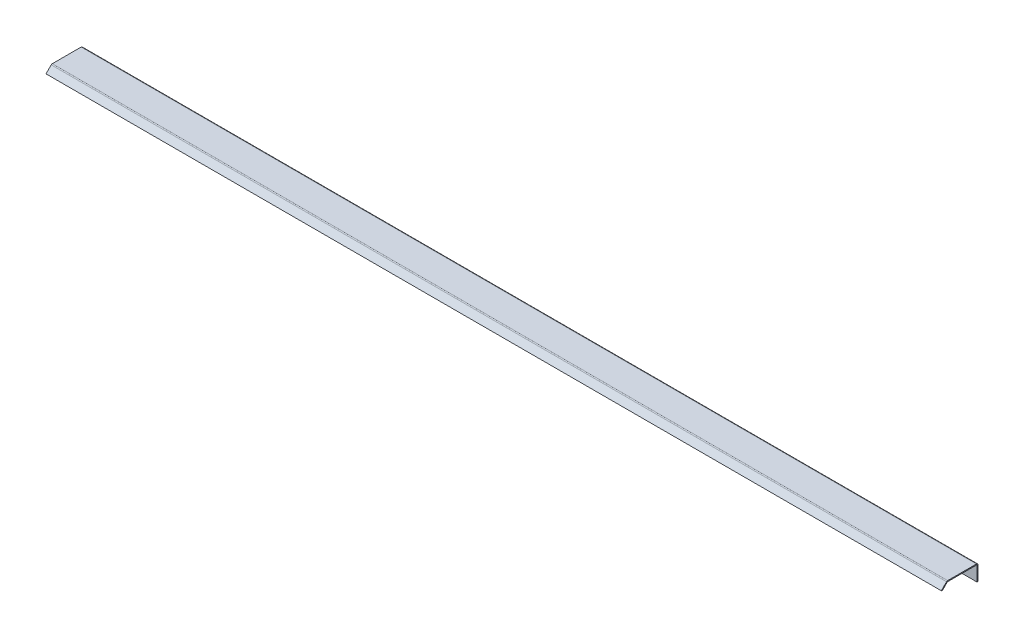
ISO-10303-21;
HEADER;
FILE_DESCRIPTION(('STEP AP214'),'2;1');
FILE_NAME('part.step','',(''),(''),'','','');
FILE_SCHEMA(('AUTOMOTIVE_DESIGN { 1 0 10303 214 1 1 1 1 }'));
ENDSEC;
DATA;
#1=APPLICATION_CONTEXT('core data for automotive mechanical design processes');
#2=APPLICATION_PROTOCOL_DEFINITION('international standard','automotive_design',2000,#1);
#3=PRODUCT_CONTEXT('',#1,'mechanical');
#4=PRODUCT('Part','Part','',(#3));
#5=PRODUCT_RELATED_PRODUCT_CATEGORY('part','',(#4));
#6=PRODUCT_DEFINITION_FORMATION('','',#4);
#7=PRODUCT_DEFINITION_CONTEXT('part definition',#1,'design');
#8=PRODUCT_DEFINITION('design','',#6,#7);
#9=PRODUCT_DEFINITION_SHAPE('','',#8);
#10=(LENGTH_UNIT() NAMED_UNIT(*) SI_UNIT(.MILLI.,.METRE.));
#11=(NAMED_UNIT(*) PLANE_ANGLE_UNIT() SI_UNIT($,.RADIAN.));
#12=(NAMED_UNIT(*) SI_UNIT($,.STERADIAN.) SOLID_ANGLE_UNIT());
#13=UNCERTAINTY_MEASURE_WITH_UNIT(LENGTH_MEASURE(1.E-05),#10,'distance_accuracy_value','');
#14=(GEOMETRIC_REPRESENTATION_CONTEXT(3) GLOBAL_UNCERTAINTY_ASSIGNED_CONTEXT((#13)) GLOBAL_UNIT_ASSIGNED_CONTEXT((#10,
#11,#12)) REPRESENTATION_CONTEXT('',''));
#15=CARTESIAN_POINT('',(0.,0.,0.));
#16=DIRECTION('',(0.,0.,1.));
#17=DIRECTION('',(1.,0.,0.));
#18=AXIS2_PLACEMENT_3D('',#15,#16,#17);
#19=CARTESIAN_POINT('',(-560.,-1.93660000000001,1.19999999999998));
#20=DIRECTION('',(-1.,0.,0.));
#21=DIRECTION('',(0.,0.,1.));
#22=AXIS2_PLACEMENT_3D('',#19,#20,#21);
#23=PLANE('',#22);
#24=DIRECTION('',(0.,0.,1.));
#25=VECTOR('',#24,1.);
#26=CARTESIAN_POINT('',(-560.,-1.19999999999998,0.));
#27=LINE('',#26,#25);
#28=CARTESIAN_POINT('',(-560.,-1.19999999999998,1.93659999999996));
#29=VERTEX_POINT('',#28);
#30=CARTESIAN_POINT('',(-560.,-1.20000000000003,37.9978340151083));
#31=VERTEX_POINT('',#30);
#32=EDGE_CURVE('E273',#29,#31,#27,.T.);
#33=ORIENTED_EDGE('',*,*,#32,.T.);
#34=DIRECTION('',(0.,1.,0.));
#35=VECTOR('',#34,1.);
#36=CARTESIAN_POINT('',(-560.,-1.20000000000015,37.9978340151083));
#37=LINE('',#36,#35);
#38=CARTESIAN_POINT('',(-560.,-1.66533453693773E-13,37.9978340151083));
#39=VERTEX_POINT('',#38);
#40=EDGE_CURVE('E228',#31,#39,#37,.T.);
#41=ORIENTED_EDGE('',*,*,#40,.T.);
#42=DIRECTION('',(0.,0.,1.));
#43=VECTOR('',#42,1.);
#44=CARTESIAN_POINT('',(-560.,0.,0.));
#45=LINE('',#44,#43);
#46=CARTESIAN_POINT('',(-560.,0.,1.93659999999996));
#47=VERTEX_POINT('',#46);
#48=EDGE_CURVE('E239',#47,#39,#45,.T.);
#49=ORIENTED_EDGE('',*,*,#48,.F.);
#50=DIRECTION('',(0.,-1.,0.));
#51=VECTOR('',#50,1.);
#52=CARTESIAN_POINT('',(-560.,0.,1.93659999999996));
#53=LINE('',#52,#51);
#54=EDGE_CURVE('E319',#47,#29,#53,.T.);
#55=ORIENTED_EDGE('',*,*,#54,.T.);
#56=EDGE_LOOP('',(#33,#41,#49,#55));
#57=FACE_BOUND('',#56,.T.);
#58=ADVANCED_FACE('F64',(#57),#23,.T.);
#59=CARTESIAN_POINT('',(560.,0.,0.));
#60=DIRECTION('',(0.,-1.,0.));
#61=DIRECTION('',(0.,0.,-1.));
#62=AXIS2_PLACEMENT_3D('',#59,#60,#61);
#63=PLANE('',#62);
#64=DIRECTION('',(-1.,0.,0.));
#65=VECTOR('',#64,1.);
#66=CARTESIAN_POINT('',(-560.,-1.66533453693773E-13,37.9978340151083));
#67=LINE('',#66,#65);
#68=CARTESIAN_POINT('',(559.999999999999,0.,37.9978340151083));
#69=VERTEX_POINT('',#68);
#70=EDGE_CURVE('E163',#39,#69,#67,.F.);
#71=ORIENTED_EDGE('',*,*,#70,.T.);
#72=DIRECTION('',(0.,0.,1.));
#73=VECTOR('',#72,1.);
#74=CARTESIAN_POINT('',(560.,0.,0.));
#75=LINE('',#74,#73);
#76=CARTESIAN_POINT('',(560.,0.,1.93659999999996));
#77=VERTEX_POINT('',#76);
#78=EDGE_CURVE('E243',#77,#69,#75,.T.);
#79=ORIENTED_EDGE('',*,*,#78,.F.);
#80=DIRECTION('',(-1.,0.,0.));
#81=VECTOR('',#80,1.);
#82=CARTESIAN_POINT('',(560.,0.,1.93659999999996));
#83=LINE('',#82,#81);
#84=EDGE_CURVE('E270',#77,#47,#83,.T.);
#85=ORIENTED_EDGE('',*,*,#84,.T.);
#86=ORIENTED_EDGE('',*,*,#48,.T.);
#87=EDGE_LOOP('',(#71,#79,#85,#86));
#88=FACE_BOUND('',#87,.T.);
#89=ADVANCED_FACE('F335',(#88),#63,.F.);
#90=CARTESIAN_POINT('',(560.,-1.19999999999998,0.));
#91=DIRECTION('',(0.,-1.,0.));
#92=DIRECTION('',(0.,0.,-1.));
#93=AXIS2_PLACEMENT_3D('',#90,#91,#92);
#94=PLANE('',#93);
#95=DIRECTION('',(0.,0.,1.));
#96=VECTOR('',#95,1.);
#97=CARTESIAN_POINT('',(560.,-1.19999999999998,0.));
#98=LINE('',#97,#96);
#99=CARTESIAN_POINT('',(560.,-1.19999999999998,1.93659999999996));
#100=VERTEX_POINT('',#99);
#101=CARTESIAN_POINT('',(560.,-1.20000000000003,37.9978340151083));
#102=VERTEX_POINT('',#101);
#103=EDGE_CURVE('E246',#100,#102,#98,.T.);
#104=ORIENTED_EDGE('',*,*,#103,.T.);
#105=DIRECTION('',(-1.,0.,0.));
#106=VECTOR('',#105,1.);
#107=CARTESIAN_POINT('',(-560.,-1.20000000000015,37.9978340151083));
#108=LINE('',#107,#106);
#109=EDGE_CURVE('E80',#31,#102,#108,.F.);
#110=ORIENTED_EDGE('',*,*,#109,.F.);
#111=ORIENTED_EDGE('',*,*,#32,.F.);
#112=DIRECTION('',(-1.,0.,0.));
#113=VECTOR('',#112,1.);
#114=CARTESIAN_POINT('',(560.,-1.19999999999998,1.93659999999996));
#115=LINE('',#114,#113);
#116=EDGE_CURVE('E312',#100,#29,#115,.T.);
#117=ORIENTED_EDGE('',*,*,#116,.F.);
#118=EDGE_LOOP('',(#104,#110,#111,#117));
#119=FACE_BOUND('',#118,.T.);
#120=ADVANCED_FACE('F373',(#119),#94,.T.);
#121=CARTESIAN_POINT('',(560.,-1.93660000000001,0.));
#122=DIRECTION('',(1.,0.,0.));
#123=DIRECTION('',(0.,0.,-1.));
#124=AXIS2_PLACEMENT_3D('',#121,#122,#123);
#125=PLANE('',#124);
#126=DIRECTION('',(0.,0.,1.));
#127=VECTOR('',#126,1.);
#128=CARTESIAN_POINT('',(560.,-1.93660000000001,0.));
#129=LINE('',#128,#127);
#130=CARTESIAN_POINT('',(560.,-1.93660000000001,0.));
#131=VERTEX_POINT('',#130);
#132=CARTESIAN_POINT('',(560.,-1.93660000000001,1.19999999999998));
#133=VERTEX_POINT('',#132);
#134=EDGE_CURVE('E13',#131,#133,#129,.T.);
#135=ORIENTED_EDGE('',*,*,#134,.F.);
#136=CARTESIAN_POINT('',(560.,-1.93660000000001,1.93659999999996));
#137=DIRECTION('',(-1.,0.,0.));
#138=DIRECTION('',(0.,0.,1.));
#139=AXIS2_PLACEMENT_3D('',#136,#137,#138);
#140=CIRCLE('',#139,1.9366);
#141=EDGE_CURVE('E266',#131,#77,#140,.F.);
#142=ORIENTED_EDGE('',*,*,#141,.T.);
#143=DIRECTION('',(0.,1.,0.));
#144=VECTOR('',#143,1.);
#145=CARTESIAN_POINT('',(560.,-1.19999999999998,1.93659999999996));
#146=LINE('',#145,#144);
#147=EDGE_CURVE('E73',#100,#77,#146,.T.);
#148=ORIENTED_EDGE('',*,*,#147,.F.);
#149=CARTESIAN_POINT('',(560.,-1.93660000000001,1.93659999999996));
#150=DIRECTION('',(1.,0.,0.));
#151=DIRECTION('',(0.,0.,-1.));
#152=AXIS2_PLACEMENT_3D('',#149,#150,#151);
#153=CIRCLE('',#152,0.7366);
#154=EDGE_CURVE('E250',#133,#100,#153,.T.);
#155=ORIENTED_EDGE('',*,*,#154,.F.);
#156=EDGE_LOOP('',(#135,#142,#148,#155));
#157=FACE_BOUND('',#156,.T.);
#158=ADVANCED_FACE('F66',(#157),#125,.T.);
#159=CARTESIAN_POINT('',(560.,-1.19999999999998,1.93659999999996));
#160=DIRECTION('',(1.,0.,0.));
#161=DIRECTION('',(0.,0.,-1.));
#162=AXIS2_PLACEMENT_3D('',#159,#160,#161);
#163=PLANE('',#162);
#164=DIRECTION('',(0.,1.,0.));
#165=VECTOR('',#164,1.);
#166=CARTESIAN_POINT('',(560.,-20.,0.));
#167=LINE('',#166,#165);
#168=CARTESIAN_POINT('',(560.,-20.,0.));
#169=VERTEX_POINT('',#168);
#170=EDGE_CURVE('E262',#169,#131,#167,.T.);
#171=ORIENTED_EDGE('',*,*,#170,.T.);
#172=ORIENTED_EDGE('',*,*,#134,.T.);
#173=DIRECTION('',(0.,1.,0.));
#174=VECTOR('',#173,1.);
#175=CARTESIAN_POINT('',(560.,-20.,1.19999999999998));
#176=LINE('',#175,#174);
#177=CARTESIAN_POINT('',(560.,-20.,1.19999999999998));
#178=VERTEX_POINT('',#177);
#179=EDGE_CURVE('E254',#178,#133,#176,.T.);
#180=ORIENTED_EDGE('',*,*,#179,.F.);
#181=DIRECTION('',(0.,0.,1.));
#182=VECTOR('',#181,1.);
#183=CARTESIAN_POINT('',(560.,-20.,0.));
#184=LINE('',#183,#182);
#185=EDGE_CURVE('E258',#169,#178,#184,.T.);
#186=ORIENTED_EDGE('',*,*,#185,.F.);
#187=EDGE_LOOP('',(#171,#172,#180,#186));
#188=FACE_BOUND('',#187,.T.);
#189=ADVANCED_FACE('F380',(#188),#163,.T.);
#190=CARTESIAN_POINT('',(-560.,0.,1.93659999999996));
#191=DIRECTION('',(-1.,0.,0.));
#192=DIRECTION('',(0.,0.,1.));
#193=AXIS2_PLACEMENT_3D('',#190,#191,#192);
#194=PLANE('',#193);
#195=ORIENTED_EDGE('',*,*,#54,.F.);
#196=CARTESIAN_POINT('',(-560.,-1.93660000000001,1.93659999999996));
#197=DIRECTION('',(-1.,0.,0.));
#198=DIRECTION('',(0.,0.,1.));
#199=AXIS2_PLACEMENT_3D('',#196,#197,#198);
#200=CIRCLE('',#199,1.9366);
#201=CARTESIAN_POINT('',(-560.,-1.93660000000001,0.));
#202=VERTEX_POINT('',#201);
#203=EDGE_CURVE('E247',#202,#47,#200,.F.);
#204=ORIENTED_EDGE('',*,*,#203,.F.);
#205=DIRECTION('',(0.,0.,-1.));
#206=VECTOR('',#205,1.);
#207=CARTESIAN_POINT('',(-560.,-1.93660000000001,1.19999999999998));
#208=LINE('',#207,#206);
#209=CARTESIAN_POINT('',(-560.,-1.93660000000001,1.19999999999998));
#210=VERTEX_POINT('',#209);
#211=EDGE_CURVE('E316',#210,#202,#208,.T.);
#212=ORIENTED_EDGE('',*,*,#211,.F.);
#213=CARTESIAN_POINT('',(-560.,-1.93660000000001,1.93659999999996));
#214=DIRECTION('',(1.,0.,0.));
#215=DIRECTION('',(0.,0.,-1.));
#216=AXIS2_PLACEMENT_3D('',#213,#214,#215);
#217=CIRCLE('',#216,0.7366);
#218=EDGE_CURVE('E276',#210,#29,#217,.T.);
#219=ORIENTED_EDGE('',*,*,#218,.T.);
#220=EDGE_LOOP('',(#195,#204,#212,#219));
#221=FACE_BOUND('',#220,.T.);
#222=ADVANCED_FACE('F377',(#221),#194,.T.);
#223=CARTESIAN_POINT('',(560.,-1.93660000000001,1.93659999999996));
#224=DIRECTION('',(-1.,0.,0.));
#225=DIRECTION('',(0.,0.,1.));
#226=AXIS2_PLACEMENT_3D('',#223,#224,#225);
#227=CYLINDRICAL_SURFACE('',#226,0.7366);
#228=ORIENTED_EDGE('',*,*,#218,.F.);
#229=DIRECTION('',(-1.,0.,0.));
#230=VECTOR('',#229,1.);
#231=CARTESIAN_POINT('',(560.,-1.93660000000001,1.19999999999998));
#232=LINE('',#231,#230);
#233=EDGE_CURVE('E308',#133,#210,#232,.T.);
#234=ORIENTED_EDGE('',*,*,#233,.F.);
#235=ORIENTED_EDGE('',*,*,#154,.T.);
#236=ORIENTED_EDGE('',*,*,#116,.T.);
#237=EDGE_LOOP('',(#228,#234,#235,#236));
#238=FACE_BOUND('',#237,.T.);
#239=ADVANCED_FACE('F379',(#238),#227,.F.);
#240=CARTESIAN_POINT('',(560.,-20.,1.19999999999998));
#241=DIRECTION('',(0.,0.,1.));
#242=DIRECTION('',(1.,0.,0.));
#243=AXIS2_PLACEMENT_3D('',#240,#241,#242);
#244=PLANE('',#243);
#245=DIRECTION('',(0.,1.,0.));
#246=VECTOR('',#245,1.);
#247=CARTESIAN_POINT('',(-560.,-20.,1.19999999999998));
#248=LINE('',#247,#246);
#249=CARTESIAN_POINT('',(-560.,-20.,1.19999999999998));
#250=VERTEX_POINT('',#249);
#251=EDGE_CURVE('E280',#250,#210,#248,.T.);
#252=ORIENTED_EDGE('',*,*,#251,.F.);
#253=DIRECTION('',(-1.,0.,0.));
#254=VECTOR('',#253,1.);
#255=CARTESIAN_POINT('',(560.,-20.,1.19999999999998));
#256=LINE('',#255,#254);
#257=EDGE_CURVE('E305',#178,#250,#256,.T.);
#258=ORIENTED_EDGE('',*,*,#257,.F.);
#259=ORIENTED_EDGE('',*,*,#179,.T.);
#260=ORIENTED_EDGE('',*,*,#233,.T.);
#261=EDGE_LOOP('',(#252,#258,#259,#260));
#262=FACE_BOUND('',#261,.T.);
#263=ADVANCED_FACE('F403',(#262),#244,.T.);
#264=CARTESIAN_POINT('',(560.,-20.,0.));
#265=DIRECTION('',(0.,-1.,0.));
#266=DIRECTION('',(0.,0.,-1.));
#267=AXIS2_PLACEMENT_3D('',#264,#265,#266);
#268=PLANE('',#267);
#269=DIRECTION('',(0.,0.,1.));
#270=VECTOR('',#269,1.);
#271=CARTESIAN_POINT('',(-560.,-20.,0.));
#272=LINE('',#271,#270);
#273=CARTESIAN_POINT('',(-560.,-20.,0.));
#274=VERTEX_POINT('',#273);
#275=EDGE_CURVE('E284',#274,#250,#272,.T.);
#276=ORIENTED_EDGE('',*,*,#275,.F.);
#277=DIRECTION('',(-1.,0.,0.));
#278=VECTOR('',#277,1.);
#279=CARTESIAN_POINT('',(560.,-20.,0.));
#280=LINE('',#279,#278);
#281=EDGE_CURVE('E302',#169,#274,#280,.T.);
#282=ORIENTED_EDGE('',*,*,#281,.F.);
#283=ORIENTED_EDGE('',*,*,#185,.T.);
#284=ORIENTED_EDGE('',*,*,#257,.T.);
#285=EDGE_LOOP('',(#276,#282,#283,#284));
#286=FACE_BOUND('',#285,.T.);
#287=ADVANCED_FACE('F406',(#286),#268,.T.);
#288=CARTESIAN_POINT('',(560.,-20.,0.));
#289=DIRECTION('',(0.,0.,1.));
#290=DIRECTION('',(1.,0.,0.));
#291=AXIS2_PLACEMENT_3D('',#288,#289,#290);
#292=PLANE('',#291);
#293=DIRECTION('',(0.,1.,0.));
#294=VECTOR('',#293,1.);
#295=CARTESIAN_POINT('',(-560.,-20.,0.));
#296=LINE('',#295,#294);
#297=EDGE_CURVE('E288',#274,#202,#296,.T.);
#298=ORIENTED_EDGE('',*,*,#297,.T.);
#299=DIRECTION('',(-1.,0.,0.));
#300=VECTOR('',#299,1.);
#301=CARTESIAN_POINT('',(560.,-1.93660000000001,0.));
#302=LINE('',#301,#300);
#303=EDGE_CURVE('E298',#131,#202,#302,.T.);
#304=ORIENTED_EDGE('',*,*,#303,.F.);
#305=ORIENTED_EDGE('',*,*,#170,.F.);
#306=ORIENTED_EDGE('',*,*,#281,.T.);
#307=EDGE_LOOP('',(#298,#304,#305,#306));
#308=FACE_BOUND('',#307,.T.);
#309=ADVANCED_FACE('F393',(#308),#292,.F.);
#310=CARTESIAN_POINT('',(560.,-1.93660000000001,1.93659999999996));
#311=DIRECTION('',(-1.,0.,0.));
#312=DIRECTION('',(0.,0.,1.));
#313=AXIS2_PLACEMENT_3D('',#310,#311,#312);
#314=CYLINDRICAL_SURFACE('',#313,1.9366);
#315=ORIENTED_EDGE('',*,*,#203,.T.);
#316=ORIENTED_EDGE('',*,*,#84,.F.);
#317=ORIENTED_EDGE('',*,*,#141,.F.);
#318=ORIENTED_EDGE('',*,*,#303,.T.);
#319=EDGE_LOOP('',(#315,#316,#317,#318));
#320=FACE_BOUND('',#319,.T.);
#321=ADVANCED_FACE('F331',(#320),#314,.T.);
#322=CARTESIAN_POINT('',(560.,-1.93660000000001,1.93659999999996));
#323=DIRECTION('',(1.,0.,0.));
#324=DIRECTION('',(0.,0.,-1.));
#325=AXIS2_PLACEMENT_3D('',#322,#323,#324);
#326=PLANE('',#325);
#327=DIRECTION('',(6.02890591705265E-13,1.,0.));
#328=VECTOR('',#327,1.);
#329=CARTESIAN_POINT('',(559.999999999999,-1.19999999999998,37.9978340151083));
#330=LINE('',#329,#328);
#331=EDGE_CURVE('E88',#102,#69,#330,.T.);
#332=ORIENTED_EDGE('',*,*,#331,.F.);
#333=ORIENTED_EDGE('',*,*,#103,.F.);
#334=ORIENTED_EDGE('',*,*,#147,.T.);
#335=ORIENTED_EDGE('',*,*,#78,.T.);
#336=EDGE_LOOP('',(#332,#333,#334,#335));
#337=FACE_BOUND('',#336,.T.);
#338=ADVANCED_FACE('F323',(#337),#326,.T.);
#339=CARTESIAN_POINT('',(-560.,-1.93660000000001,1.93659999999996));
#340=DIRECTION('',(1.,0.,0.));
#341=DIRECTION('',(0.,0.,-1.));
#342=AXIS2_PLACEMENT_3D('',#339,#340,#341);
#343=PLANE('',#342);
#344=ORIENTED_EDGE('',*,*,#251,.T.);
#345=ORIENTED_EDGE('',*,*,#211,.T.);
#346=ORIENTED_EDGE('',*,*,#297,.F.);
#347=ORIENTED_EDGE('',*,*,#275,.T.);
#348=EDGE_LOOP('',(#344,#345,#346,#347));
#349=FACE_BOUND('',#348,.T.);
#350=ADVANCED_FACE('F415',(#349),#343,.F.);
#351=CARTESIAN_POINT('',(560.,-1.93659999999996,37.9978340151083));
#352=DIRECTION('',(1.,0.,0.));
#353=DIRECTION('',(0.,1.,0.));
#354=AXIS2_PLACEMENT_3D('',#351,#352,#353);
#355=PLANE('',#354);
#356=DIRECTION('',(0.,0.707106781186551,0.707106781186544));
#357=VECTOR('',#356,1.);
#358=CARTESIAN_POINT('',(560.,-0.567217007554133,39.3672170075541));
#359=LINE('',#358,#357);
#360=CARTESIAN_POINT('',(559.999999999999,-1.415745144978,38.5186888701302));
#361=VERTEX_POINT('',#360);
#362=CARTESIAN_POINT('',(559.999999999999,-0.567217007554133,39.3672170075541));
#363=VERTEX_POINT('',#362);
#364=EDGE_CURVE('E220',#361,#363,#359,.T.);
#365=ORIENTED_EDGE('',*,*,#364,.F.);
#366=CARTESIAN_POINT('',(560.,-1.93659999999996,37.9978340151083));
#367=DIRECTION('',(-1.,0.,0.));
#368=DIRECTION('',(0.,-1.,0.));
#369=AXIS2_PLACEMENT_3D('',#366,#367,#368);
#370=CIRCLE('',#369,0.736599999999941);
#371=EDGE_CURVE('E167',#102,#361,#370,.F.);
#372=ORIENTED_EDGE('',*,*,#371,.F.);
#373=ORIENTED_EDGE('',*,*,#331,.T.);
#374=CARTESIAN_POINT('',(559.999999999999,-1.93659999999996,37.9978340151083));
#375=DIRECTION('',(-1.,0.,0.));
#376=DIRECTION('',(0.,-1.,0.));
#377=AXIS2_PLACEMENT_3D('',#374,#375,#376);
#378=CIRCLE('',#377,1.93659999999994);
#379=EDGE_CURVE('E226',#69,#363,#378,.F.);
#380=ORIENTED_EDGE('',*,*,#379,.T.);
#381=EDGE_LOOP('',(#365,#372,#373,#380));
#382=FACE_BOUND('',#381,.T.);
#383=ADVANCED_FACE('F338',(#382),#355,.T.);
#384=CARTESIAN_POINT('',(-560.,-1.93660000000012,37.9978340151083));
#385=DIRECTION('',(1.,0.,0.));
#386=DIRECTION('',(0.,1.,0.));
#387=AXIS2_PLACEMENT_3D('',#384,#385,#386);
#388=PLANE('',#387);
#389=CARTESIAN_POINT('',(-560.,-1.93660000000012,37.9978340151083));
#390=DIRECTION('',(-1.,0.,0.));
#391=DIRECTION('',(0.,-1.,0.));
#392=AXIS2_PLACEMENT_3D('',#389,#390,#391);
#393=CIRCLE('',#392,0.736599999999941);
#394=CARTESIAN_POINT('',(-560.,-1.41574514497811,38.5186888701302));
#395=VERTEX_POINT('',#394);
#396=EDGE_CURVE('E174',#395,#31,#393,.T.);
#397=ORIENTED_EDGE('',*,*,#396,.F.);
#398=DIRECTION('',(0.,0.707106781186551,0.707106781186544));
#399=VECTOR('',#398,1.);
#400=CARTESIAN_POINT('',(-560.,-1.415745144978,38.5186888701303));
#401=LINE('',#400,#399);
#402=CARTESIAN_POINT('',(-560.,-0.567217007554188,39.3672170075541));
#403=VERTEX_POINT('',#402);
#404=EDGE_CURVE('E171',#395,#403,#401,.T.);
#405=ORIENTED_EDGE('',*,*,#404,.T.);
#406=CARTESIAN_POINT('',(-560.,-1.93660000000012,37.9978340151083));
#407=DIRECTION('',(-1.,0.,0.));
#408=DIRECTION('',(0.,-1.,0.));
#409=AXIS2_PLACEMENT_3D('',#406,#407,#408);
#410=CIRCLE('',#409,1.93659999999994);
#411=EDGE_CURVE('E155',#403,#39,#410,.T.);
#412=ORIENTED_EDGE('',*,*,#411,.T.);
#413=ORIENTED_EDGE('',*,*,#40,.F.);
#414=EDGE_LOOP('',(#397,#405,#412,#413));
#415=FACE_BOUND('',#414,.T.);
#416=ADVANCED_FACE('F172',(#415),#388,.F.);
#417=CARTESIAN_POINT('',(-560.,-1.93660000000012,37.9978340151083));
#418=DIRECTION('',(-1.,0.,0.));
#419=DIRECTION('',(0.,0.707106781186551,0.707106781186544));
#420=AXIS2_PLACEMENT_3D('',#417,#418,#419);
#421=CYLINDRICAL_SURFACE('',#420,1.93659999999994);
#422=ORIENTED_EDGE('',*,*,#70,.F.);
#423=ORIENTED_EDGE('',*,*,#411,.F.);
#424=DIRECTION('',(-1.,0.,0.));
#425=VECTOR('',#424,1.);
#426=CARTESIAN_POINT('',(0.,-0.567217007554133,39.3672170075541));
#427=LINE('',#426,#425);
#428=EDGE_CURVE('E160',#363,#403,#427,.T.);
#429=ORIENTED_EDGE('',*,*,#428,.F.);
#430=ORIENTED_EDGE('',*,*,#379,.F.);
#431=EDGE_LOOP('',(#422,#423,#429,#430));
#432=FACE_BOUND('',#431,.T.);
#433=ADVANCED_FACE('F157',(#432),#421,.T.);
#434=CARTESIAN_POINT('',(-560.,-1.93660000000012,37.9978340151083));
#435=DIRECTION('',(-1.,0.,0.));
#436=DIRECTION('',(0.,0.707106781186551,0.707106781186544));
#437=AXIS2_PLACEMENT_3D('',#434,#435,#436);
#438=CYLINDRICAL_SURFACE('',#437,0.736599999999941);
#439=ORIENTED_EDGE('',*,*,#109,.T.);
#440=ORIENTED_EDGE('',*,*,#371,.T.);
#441=DIRECTION('',(1.,0.,0.));
#442=VECTOR('',#441,1.);
#443=CARTESIAN_POINT('',(560.,-1.415745144978,38.5186888701302));
#444=LINE('',#443,#442);
#445=EDGE_CURVE('E180',#361,#395,#444,.F.);
#446=ORIENTED_EDGE('',*,*,#445,.T.);
#447=ORIENTED_EDGE('',*,*,#396,.T.);
#448=EDGE_LOOP('',(#439,#440,#446,#447));
#449=FACE_BOUND('',#448,.T.);
#450=ADVANCED_FACE('F341',(#449),#438,.F.);
#451=CARTESIAN_POINT('',(-560.,-0.351471862576169,39.1514718625762));
#452=DIRECTION('',(-1.,0.,0.));
#453=DIRECTION('',(0.,0.,1.));
#454=AXIS2_PLACEMENT_3D('',#451,#452,#453);
#455=PLANE('',#454);
#456=DIRECTION('',(0.,0.707106781186544,-0.707106781186551));
#457=VECTOR('',#456,1.);
#458=CARTESIAN_POINT('',(-560.,-0.351471862576169,39.1514718625762));
#459=LINE('',#458,#457);
#460=CARTESIAN_POINT('',(-560.,-7.07106781186537,45.8710678118655));
#461=VERTEX_POINT('',#460);
#462=EDGE_CURVE('E187',#461,#403,#459,.T.);
#463=ORIENTED_EDGE('',*,*,#462,.T.);
#464=ORIENTED_EDGE('',*,*,#404,.F.);
#465=DIRECTION('',(0.,-0.707106781186544,0.707106781186551));
#466=VECTOR('',#465,1.);
#467=CARTESIAN_POINT('',(-560.,19.4,17.702943725152));
#468=LINE('',#467,#466);
#469=CARTESIAN_POINT('',(-560.,-7.91959594928923,45.0225396744417));
#470=VERTEX_POINT('',#469);
#471=EDGE_CURVE('E211',#470,#395,#468,.F.);
#472=ORIENTED_EDGE('',*,*,#471,.F.);
#473=DIRECTION('',(0.,-0.707106781186551,-0.707106781186544));
#474=VECTOR('',#473,1.);
#475=CARTESIAN_POINT('',(-560.,-7.07106781186537,45.8710678118655));
#476=LINE('',#475,#474);
#477=EDGE_CURVE('E193',#461,#470,#476,.T.);
#478=ORIENTED_EDGE('',*,*,#477,.F.);
#479=EDGE_LOOP('',(#463,#464,#472,#478));
#480=FACE_BOUND('',#479,.T.);
#481=ADVANCED_FACE('F192',(#480),#455,.T.);
#482=CARTESIAN_POINT('',(560.,-7.07106781186537,45.8710678118655));
#483=DIRECTION('',(1.,0.,0.));
#484=DIRECTION('',(0.,0.,-1.));
#485=AXIS2_PLACEMENT_3D('',#482,#483,#484);
#486=PLANE('',#485);
#487=DIRECTION('',(0.,0.707106781186544,-0.707106781186551));
#488=VECTOR('',#487,1.);
#489=CARTESIAN_POINT('',(560.,19.4000000000046,17.7029437251475));
#490=LINE('',#489,#488);
#491=CARTESIAN_POINT('',(560.,-7.91959594928923,45.0225396744417));
#492=VERTEX_POINT('',#491);
#493=EDGE_CURVE('E190',#361,#492,#490,.F.);
#494=ORIENTED_EDGE('',*,*,#493,.F.);
#495=ORIENTED_EDGE('',*,*,#364,.T.);
#496=DIRECTION('',(0.,-0.707106781186544,0.707106781186551));
#497=VECTOR('',#496,1.);
#498=CARTESIAN_POINT('',(560.,-7.07106781186537,45.8710678118655));
#499=LINE('',#498,#497);
#500=CARTESIAN_POINT('',(560.,-7.07106781186537,45.8710678118655));
#501=VERTEX_POINT('',#500);
#502=EDGE_CURVE('E188',#363,#501,#499,.T.);
#503=ORIENTED_EDGE('',*,*,#502,.T.);
#504=DIRECTION('',(0.,-0.707106781186551,-0.707106781186544));
#505=VECTOR('',#504,1.);
#506=CARTESIAN_POINT('',(560.,-7.07106781186537,45.8710678118655));
#507=LINE('',#506,#505);
#508=EDGE_CURVE('E196',#501,#492,#507,.T.);
#509=ORIENTED_EDGE('',*,*,#508,.T.);
#510=EDGE_LOOP('',(#494,#495,#503,#509));
#511=FACE_BOUND('',#510,.T.);
#512=ADVANCED_FACE('F346',(#511),#486,.T.);
#513=CARTESIAN_POINT('',(0.,20.2485281374238,18.5514718625759));
#514=DIRECTION('',(0.,0.707106781186551,0.707106781186544));
#515=DIRECTION('',(0.,-0.707106781186544,0.707106781186551));
#516=AXIS2_PLACEMENT_3D('',#513,#514,#515);
#517=PLANE('',#516);
#518=ORIENTED_EDGE('',*,*,#502,.F.);
#519=ORIENTED_EDGE('',*,*,#428,.T.);
#520=ORIENTED_EDGE('',*,*,#462,.F.);
#521=DIRECTION('',(-1.,0.,0.));
#522=VECTOR('',#521,1.);
#523=CARTESIAN_POINT('',(-560.,-7.07106781186537,45.8710678118655));
#524=LINE('',#523,#522);
#525=EDGE_CURVE('E197',#501,#461,#524,.T.);
#526=ORIENTED_EDGE('',*,*,#525,.F.);
#527=EDGE_LOOP('',(#518,#519,#520,#526));
#528=FACE_BOUND('',#527,.T.);
#529=ADVANCED_FACE('F185',(#528),#517,.T.);
#530=CARTESIAN_POINT('',(0.,19.4,17.702943725152));
#531=DIRECTION('',(0.,0.707106781186551,0.707106781186544));
#532=DIRECTION('',(0.,-0.707106781186544,0.707106781186551));
#533=AXIS2_PLACEMENT_3D('',#530,#531,#532);
#534=PLANE('',#533);
#535=ORIENTED_EDGE('',*,*,#445,.F.);
#536=ORIENTED_EDGE('',*,*,#493,.T.);
#537=DIRECTION('',(1.,0.,0.));
#538=VECTOR('',#537,1.);
#539=CARTESIAN_POINT('',(0.,-7.91959594928923,45.0225396744417));
#540=LINE('',#539,#538);
#541=EDGE_CURVE('E213',#492,#470,#540,.F.);
#542=ORIENTED_EDGE('',*,*,#541,.T.);
#543=ORIENTED_EDGE('',*,*,#471,.T.);
#544=EDGE_LOOP('',(#535,#536,#542,#543));
#545=FACE_BOUND('',#544,.T.);
#546=ADVANCED_FACE('F344',(#545),#534,.F.);
#547=CARTESIAN_POINT('',(-560.,-7.07106781186537,45.8710678118655));
#548=DIRECTION('',(0.,-0.707106781186544,0.707106781186551));
#549=DIRECTION('',(0.,-0.707106781186551,-0.707106781186544));
#550=AXIS2_PLACEMENT_3D('',#547,#548,#549);
#551=PLANE('',#550);
#552=ORIENTED_EDGE('',*,*,#541,.F.);
#553=ORIENTED_EDGE('',*,*,#508,.F.);
#554=ORIENTED_EDGE('',*,*,#525,.T.);
#555=ORIENTED_EDGE('',*,*,#477,.T.);
#556=EDGE_LOOP('',(#552,#553,#554,#555));
#557=FACE_BOUND('',#556,.T.);
#558=ADVANCED_FACE('F350',(#557),#551,.T.);
#559=CLOSED_SHELL('',(#58,#89,#120,#158,#189,#222,#239,#263,#287,#309,#321,#338,#350,#383,#416,
#433,#450,#481,#512,#529,#546,#558));
#560=MANIFOLD_SOLID_BREP('B2',#559);
#561=ADVANCED_BREP_SHAPE_REPRESENTATION('',(#18,#560),#14);
#562=SHAPE_DEFINITION_REPRESENTATION(#9,#561);
ENDSEC;
END-ISO-10303-21;
